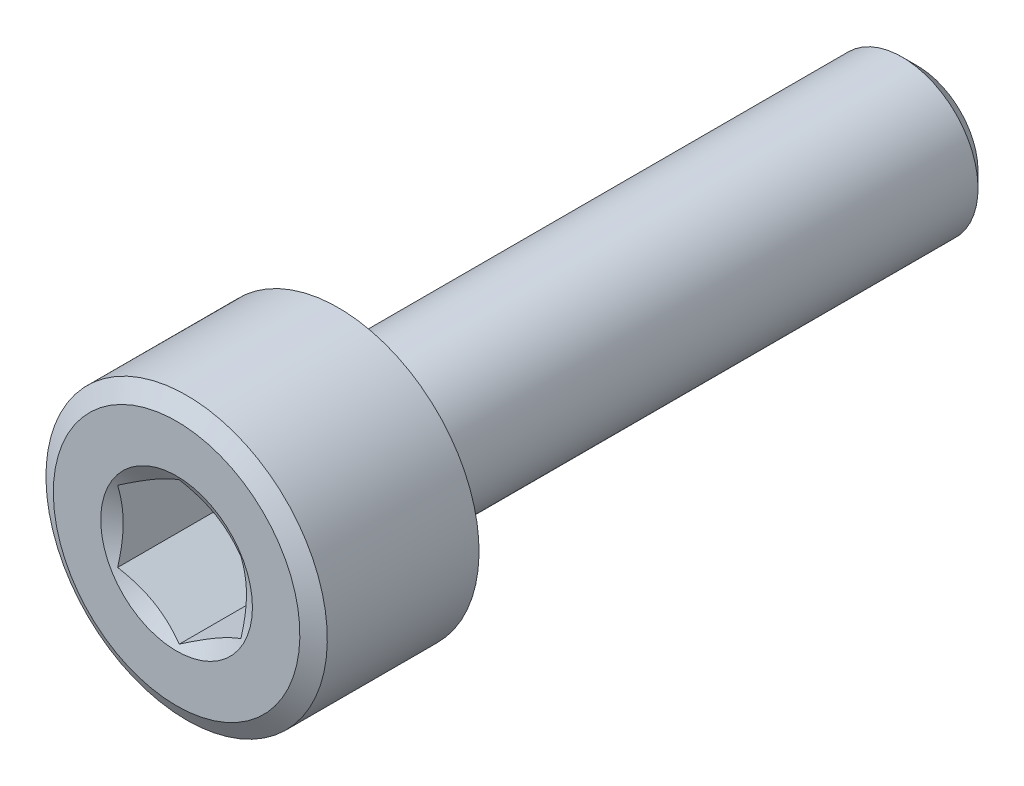
ISO-10303-21;
HEADER;
FILE_DESCRIPTION(('STEP AP214'),'2;1');
FILE_NAME('part.step','',(''),(''),'','','');
FILE_SCHEMA(('AUTOMOTIVE_DESIGN { 1 0 10303 214 1 1 1 1 }'));
ENDSEC;
DATA;
#1=APPLICATION_CONTEXT('core data for automotive mechanical design processes');
#2=APPLICATION_PROTOCOL_DEFINITION('international standard','automotive_design',2000,#1);
#3=PRODUCT_CONTEXT('',#1,'mechanical');
#4=PRODUCT('Part','Part','',(#3));
#5=PRODUCT_RELATED_PRODUCT_CATEGORY('part','',(#4));
#6=PRODUCT_DEFINITION_FORMATION('','',#4);
#7=PRODUCT_DEFINITION_CONTEXT('part definition',#1,'design');
#8=PRODUCT_DEFINITION('design','',#6,#7);
#9=PRODUCT_DEFINITION_SHAPE('','',#8);
#10=(LENGTH_UNIT() NAMED_UNIT(*) SI_UNIT(.MILLI.,.METRE.));
#11=(NAMED_UNIT(*) PLANE_ANGLE_UNIT() SI_UNIT($,.RADIAN.));
#12=(NAMED_UNIT(*) SI_UNIT($,.STERADIAN.) SOLID_ANGLE_UNIT());
#13=UNCERTAINTY_MEASURE_WITH_UNIT(LENGTH_MEASURE(1.E-05),#10,'distance_accuracy_value','');
#14=(GEOMETRIC_REPRESENTATION_CONTEXT(3) GLOBAL_UNCERTAINTY_ASSIGNED_CONTEXT((#13)) GLOBAL_UNIT_ASSIGNED_CONTEXT((#10,
#11,#12)) REPRESENTATION_CONTEXT('',''));
#15=CARTESIAN_POINT('',(0.,0.,0.));
#16=DIRECTION('',(0.,0.,1.));
#17=DIRECTION('',(1.,0.,0.));
#18=AXIS2_PLACEMENT_3D('',#15,#16,#17);
#19=CARTESIAN_POINT('',(0.,0.,0.));
#20=DIRECTION('',(0.,0.,-1.));
#21=DIRECTION('',(0.,1.,0.));
#22=AXIS2_PLACEMENT_3D('',#19,#20,#21);
#23=PLANE('',#22);
#24=CARTESIAN_POINT('',(0.,0.,0.));
#25=DIRECTION('',(0.,0.,1.));
#26=DIRECTION('',(1.,0.,0.));
#27=AXIS2_PLACEMENT_3D('',#24,#25,#26);
#28=CIRCLE('',#27,4.);
#29=CARTESIAN_POINT('',(4.,0.,0.));
#30=VERTEX_POINT('',#29);
#31=EDGE_CURVE('E219',#30,#30,#28,.T.);
#32=ORIENTED_EDGE('',*,*,#31,.F.);
#33=EDGE_LOOP('',(#32));
#34=FACE_BOUND('',#33,.T.);
#35=CARTESIAN_POINT('',(0.,0.,0.));
#36=DIRECTION('',(0.,0.,1.));
#37=DIRECTION('',(0.,-1.,0.));
#38=AXIS2_PLACEMENT_3D('',#35,#36,#37);
#39=CIRCLE('',#38,6.5);
#40=CARTESIAN_POINT('',(0.,-6.5,0.));
#41=VERTEX_POINT('',#40);
#42=EDGE_CURVE('E248',#41,#41,#39,.T.);
#43=ORIENTED_EDGE('',*,*,#42,.T.);
#44=EDGE_LOOP('',(#43));
#45=FACE_BOUND('',#44,.T.);
#46=ADVANCED_FACE('F36',(#34,#45),#23,.F.);
#47=CARTESIAN_POINT('',(0.,0.,-0.53));
#48=DIRECTION('',(0.,0.,-1.));
#49=DIRECTION('',(0.,1.,0.));
#50=AXIS2_PLACEMENT_3D('',#47,#48,#49);
#51=CONICAL_SURFACE('',#50,7.4179869280115,1.0471975511966);
#52=ORIENTED_EDGE('',*,*,#42,.F.);
#53=EDGE_LOOP('',(#52));
#54=FACE_BOUND('',#53,.T.);
#55=CARTESIAN_POINT('',(0.,0.,-0.53));
#56=DIRECTION('',(0.,0.,1.));
#57=DIRECTION('',(0.,-1.,0.));
#58=AXIS2_PLACEMENT_3D('',#55,#56,#57);
#59=CIRCLE('',#58,7.4179869280115);
#60=CARTESIAN_POINT('',(0.,-7.4179869280115,-0.53));
#61=VERTEX_POINT('',#60);
#62=EDGE_CURVE('E245',#61,#61,#59,.T.);
#63=ORIENTED_EDGE('',*,*,#62,.T.);
#64=EDGE_LOOP('',(#63));
#65=FACE_BOUND('',#64,.T.);
#66=ADVANCED_FACE('F112',(#54,#65),#51,.T.);
#67=CARTESIAN_POINT('',(0.,0.,0.));
#68=DIRECTION('',(0.,0.,1.));
#69=DIRECTION('',(0.,-1.,0.));
#70=AXIS2_PLACEMENT_3D('',#67,#68,#69);
#71=CYLINDRICAL_SURFACE('',#70,7.4179869280115);
#72=ORIENTED_EDGE('',*,*,#62,.F.);
#73=EDGE_LOOP('',(#72));
#74=FACE_BOUND('',#73,.T.);
#75=CARTESIAN_POINT('',(0.,0.,-8.53));
#76=DIRECTION('',(0.,0.,1.));
#77=DIRECTION('',(0.,-1.,0.));
#78=AXIS2_PLACEMENT_3D('',#75,#76,#77);
#79=CIRCLE('',#78,7.4179869280115);
#80=CARTESIAN_POINT('',(0.,-7.4179869280115,-8.53));
#81=VERTEX_POINT('',#80);
#82=EDGE_CURVE('E242',#81,#81,#79,.T.);
#83=ORIENTED_EDGE('',*,*,#82,.T.);
#84=EDGE_LOOP('',(#83));
#85=FACE_BOUND('',#84,.T.);
#86=ADVANCED_FACE('F117',(#74,#85),#71,.T.);
#87=CARTESIAN_POINT('',(0.,0.,-9.06));
#88=DIRECTION('',(0.,0.,1.));
#89=DIRECTION('',(0.,-1.,0.));
#90=AXIS2_PLACEMENT_3D('',#87,#88,#89);
#91=CONICAL_SURFACE('',#90,6.49999999999999,1.0471975511966);
#92=ORIENTED_EDGE('',*,*,#82,.F.);
#93=EDGE_LOOP('',(#92));
#94=FACE_BOUND('',#93,.T.);
#95=CARTESIAN_POINT('',(0.,0.,-9.06));
#96=DIRECTION('',(0.,0.,1.));
#97=DIRECTION('',(0.,-1.,0.));
#98=AXIS2_PLACEMENT_3D('',#95,#96,#97);
#99=CIRCLE('',#98,6.49999999999999);
#100=CARTESIAN_POINT('',(0.,-6.49999999999999,-9.06));
#101=VERTEX_POINT('',#100);
#102=EDGE_CURVE('E238',#101,#101,#99,.T.);
#103=ORIENTED_EDGE('',*,*,#102,.T.);
#104=EDGE_LOOP('',(#103));
#105=FACE_BOUND('',#104,.T.);
#106=ADVANCED_FACE('F125',(#94,#105),#91,.T.);
#107=CARTESIAN_POINT('',(0.,6.49999999999999,-9.06));
#108=DIRECTION('',(0.,0.,1.));
#109=DIRECTION('',(0.,-1.,0.));
#110=AXIS2_PLACEMENT_3D('',#107,#108,#109);
#111=PLANE('',#110);
#112=ORIENTED_EDGE('',*,*,#102,.F.);
#113=EDGE_LOOP('',(#112));
#114=FACE_BOUND('',#113,.T.);
#115=CARTESIAN_POINT('',(0.,0.,-9.06));
#116=DIRECTION('',(0.,0.,1.));
#117=DIRECTION('',(0.,-1.,0.));
#118=AXIS2_PLACEMENT_3D('',#115,#116,#117);
#119=CIRCLE('',#118,4.);
#120=CARTESIAN_POINT('',(0.,-4.,-9.06));
#121=VERTEX_POINT('',#120);
#122=EDGE_CURVE('E235',#121,#121,#119,.T.);
#123=ORIENTED_EDGE('',*,*,#122,.T.);
#124=EDGE_LOOP('',(#123));
#125=FACE_BOUND('',#124,.T.);
#126=ADVANCED_FACE('F129',(#114,#125),#111,.F.);
#127=CARTESIAN_POINT('',(0.,0.,0.));
#128=DIRECTION('',(0.,0.,1.));
#129=DIRECTION('',(0.,-1.,0.));
#130=AXIS2_PLACEMENT_3D('',#127,#128,#129);
#131=CYLINDRICAL_SURFACE('',#130,4.);
#132=CARTESIAN_POINT('',(0.,0.,-38.26));
#133=DIRECTION('',(0.,0.,1.));
#134=DIRECTION('',(0.,-1.,0.));
#135=AXIS2_PLACEMENT_3D('',#132,#133,#134);
#136=CIRCLE('',#135,4.);
#137=CARTESIAN_POINT('',(0.,-4.,-38.26));
#138=VERTEX_POINT('',#137);
#139=EDGE_CURVE('E251',#138,#138,#136,.T.);
#140=ORIENTED_EDGE('',*,*,#139,.T.);
#141=EDGE_LOOP('',(#140));
#142=FACE_BOUND('',#141,.T.);
#143=ORIENTED_EDGE('',*,*,#122,.F.);
#144=EDGE_LOOP('',(#143));
#145=FACE_BOUND('',#144,.T.);
#146=ADVANCED_FACE('F133',(#142,#145),#131,.T.);
#147=CARTESIAN_POINT('',(0.,4.,-39.06));
#148=DIRECTION('',(0.,0.,1.));
#149=DIRECTION('',(0.,-1.,0.));
#150=AXIS2_PLACEMENT_3D('',#147,#148,#149);
#151=PLANE('',#150);
#152=CARTESIAN_POINT('',(0.,0.,-39.06));
#153=DIRECTION('',(0.,0.,1.));
#154=DIRECTION('',(0.,-1.,0.));
#155=AXIS2_PLACEMENT_3D('',#152,#153,#154);
#156=CIRCLE('',#155,3.19999999999999);
#157=CARTESIAN_POINT('',(0.,-3.19999999999999,-39.06));
#158=VERTEX_POINT('',#157);
#159=EDGE_CURVE('E51',#158,#158,#156,.F.);
#160=ORIENTED_EDGE('',*,*,#159,.T.);
#161=EDGE_LOOP('',(#160));
#162=FACE_BOUND('',#161,.T.);
#163=ADVANCED_FACE('F137',(#162),#151,.F.);
#164=CARTESIAN_POINT('',(0.,0.,-38.26));
#165=DIRECTION('',(0.,0.,1.));
#166=DIRECTION('',(0.,-1.,0.));
#167=AXIS2_PLACEMENT_3D('',#164,#165,#166);
#168=CONICAL_SURFACE('',#167,4.,0.78539816339745);
#169=ORIENTED_EDGE('',*,*,#159,.F.);
#170=EDGE_LOOP('',(#169));
#171=FACE_BOUND('',#170,.T.);
#172=ORIENTED_EDGE('',*,*,#139,.F.);
#173=EDGE_LOOP('',(#172));
#174=FACE_BOUND('',#173,.T.);
#175=ADVANCED_FACE('F39',(#171,#174),#168,.T.);
#176=CARTESIAN_POINT('',(0.,0.,-2.30940107675847));
#177=DIRECTION('',(0.,0.,1.));
#178=DIRECTION('',(1.,0.,0.));
#179=AXIS2_PLACEMENT_3D('',#176,#177,#178);
#180=CONICAL_SURFACE('',#179,0.,1.0471975511966);
#181=ORIENTED_EDGE('',*,*,#31,.T.);
#182=EDGE_LOOP('',(#181));
#183=FACE_BOUND('',#182,.T.);
#184=CARTESIAN_POINT('',(3.2502,-1.87627290481245,-0.142667740348339));
#185=CARTESIAN_POINT('',(3.10737880748063,-1.95873075875949,-0.190292955189628));
#186=CARTESIAN_POINT('',(2.96332479190713,-2.0419003834287,-0.233606431856647));
#187=CARTESIAN_POINT('',(2.67272228671431,-2.20967981802895,-0.309210723922063));
#188=CARTESIAN_POINT('',(2.52616863329362,-2.29429260928211,-0.341474792986621));
#189=CARTESIAN_POINT('',(2.2348775937677,-2.46246956936493,-0.391698768714531));
#190=CARTESIAN_POINT('',(2.09018502771157,-2.54600786132717,-0.409992938219789));
#191=CARTESIAN_POINT('',(1.80011902775738,-2.71347754448348,-0.431832814317877));
#192=CARTESIAN_POINT('',(1.6547466482515,-2.79740832692394,-0.435396605746873));
#193=CARTESIAN_POINT('',(1.38310759119938,-2.95423920963539,-0.427984785522014));
#194=CARTESIAN_POINT('',(1.25680026129147,-3.02716278055835,-0.41882902776747));
#195=CARTESIAN_POINT('',(1.00500849737306,-3.17253482323637,-0.389809996939981));
#196=CARTESIAN_POINT('',(0.879524934336008,-3.24498279213469,-0.369936809818711));
#197=CARTESIAN_POINT('',(0.62721397527239,-3.39065459226956,-0.320255122527025));
#198=CARTESIAN_POINT('',(0.500418515106996,-3.46385998532807,-0.290236012042402));
#199=CARTESIAN_POINT('',(0.248718778280333,-3.6091788961399,-0.2221043374302));
#200=CARTESIAN_POINT('',(0.123811276681379,-3.68129427581187,-0.184007783111052));
#201=CARTESIAN_POINT('',(-0.000200000000002013,-3.75289221978641,-0.142667740348337));
#202=B_SPLINE_CURVE_WITH_KNOTS('',3,(#184,#185,#186,#187,#188,#189,#190,#191,#192,#193,#194,
#195,#196,#197,#198,#199,#200,#201),.UNSPECIFIED.,.F.,.F.,(4,2,2,2,2,2,2,2,4),(0.,
0.51516683149057,1.03157201112063,1.53519622021027,2.03820193386596,2.47618783582282,
2.91457958885821,3.3626959233107,3.80993224062138),.UNSPECIFIED.);
#203=CARTESIAN_POINT('',(3.25,-1.87638837486631,-0.142734410091848));
#204=VERTEX_POINT('',#203);
#205=CARTESIAN_POINT('',(0.,-3.75277674973257,-0.142734410091833));
#206=VERTEX_POINT('',#205);
#207=EDGE_CURVE('E151',#204,#206,#202,.T.);
#208=ORIENTED_EDGE('',*,*,#207,.T.);
#209=CARTESIAN_POINT('',(0.000199999999998188,-3.75289221978641,-0.142667740348337));
#210=CARTESIAN_POINT('',(-0.142621192519368,-3.67043436583937,-0.190292955189626));
#211=CARTESIAN_POINT('',(-0.286675208092872,-3.58726474117016,-0.233606431856646));
#212=CARTESIAN_POINT('',(-0.577277713285697,-3.4194853065699,-0.309210723922062));
#213=CARTESIAN_POINT('',(-0.723831366706382,-3.33487251531675,-0.34147479298662));
#214=CARTESIAN_POINT('',(-1.0151224062323,-3.16669555523393,-0.39169876871453));
#215=CARTESIAN_POINT('',(-1.15981497228843,-3.08315726327169,-0.409992938219789));
#216=CARTESIAN_POINT('',(-1.44988097224262,-2.91568758011538,-0.431832814317876));
#217=CARTESIAN_POINT('',(-1.5952533517485,-2.83175679767492,-0.435396605746872));
#218=CARTESIAN_POINT('',(-1.86689240880062,-2.67492591496346,-0.427984785522013));
#219=CARTESIAN_POINT('',(-1.99319973870853,-2.60200234404051,-0.418829027767469));
#220=CARTESIAN_POINT('',(-2.24499150262694,-2.45663030136249,-0.389809996939981));
#221=CARTESIAN_POINT('',(-2.37047506566399,-2.38418233246417,-0.369936809818711));
#222=CARTESIAN_POINT('',(-2.62278602472761,-2.2385105323293,-0.320255122527024));
#223=CARTESIAN_POINT('',(-2.74958148489301,-2.16530513927078,-0.290236012042401));
#224=CARTESIAN_POINT('',(-3.00128122171967,-2.01998622845895,-0.2221043374302));
#225=CARTESIAN_POINT('',(-3.12618872331862,-1.94787084878699,-0.184007783111052));
#226=CARTESIAN_POINT('',(-3.2502,-1.87627290481245,-0.142667740348338));
#227=B_SPLINE_CURVE_WITH_KNOTS('',3,(#209,#210,#211,#212,#213,#214,#215,#216,#217,#218,#219,
#220,#221,#222,#223,#224,#225,#226),.UNSPECIFIED.,.F.,.F.,(4,2,2,2,2,2,2,2,4),(0.,
0.51516683149057,1.03157201112063,1.53519622021027,2.03820193386596,2.47618783582282,
2.91457958885821,3.36269592331071,3.80993224062138),.UNSPECIFIED.);
#228=CARTESIAN_POINT('',(-3.25,-1.87638837486629,-0.142734410091833));
#229=VERTEX_POINT('',#228);
#230=EDGE_CURVE('E159',#206,#229,#227,.T.);
#231=ORIENTED_EDGE('',*,*,#230,.T.);
#232=CARTESIAN_POINT('',(-3.25,-6.28302306366704,1.77466874057532));
#233=CARTESIAN_POINT('',(-3.25,-6.13618590982133,1.69937983319147));
#234=CARTESIAN_POINT('',(-3.25,-5.98912900246734,1.624515687302));
#235=CARTESIAN_POINT('',(-3.25,-5.6944759741307,1.47584932594023));
#236=CARTESIAN_POINT('',(-3.25,-5.54687984231,1.40204713196133));
#237=CARTESIAN_POINT('',(-3.25,-5.25080597530328,1.25559716966086));
#238=CARTESIAN_POINT('',(-3.25,-5.10232717529243,1.18295155018856));
#239=CARTESIAN_POINT('',(-3.25,-4.80460616133141,1.03923375269448));
#240=CARTESIAN_POINT('',(-3.25,-4.65536393637161,0.968161597443385));
#241=CARTESIAN_POINT('',(-3.25,-4.3482388240758,0.824350246031028));
#242=CARTESIAN_POINT('',(-3.25,-4.19030745994306,0.751714277013019));
#243=CARTESIAN_POINT('',(-3.25,-3.87321439087415,0.60918213039114));
#244=CARTESIAN_POINT('',(-3.25,-3.71405272059363,0.539285875948367));
#245=CARTESIAN_POINT('',(-3.25,-3.39433152435617,0.403060730219636));
#246=CARTESIAN_POINT('',(-3.25,-3.23377304115076,0.336729405465197));
#247=CARTESIAN_POINT('',(-3.25,-2.91079241277799,0.208629702903767));
#248=CARTESIAN_POINT('',(-3.25,-2.74836983060161,0.146862421397306));
#249=CARTESIAN_POINT('',(-3.25,-2.3932593347769,0.0192372651000433));
#250=CARTESIAN_POINT('',(-3.25,-2.20016296217721,-0.0455021871795711));
#251=CARTESIAN_POINT('',(-3.25,-1.81057388586937,-0.163613278802622));
#252=CARTESIAN_POINT('',(-3.25,-1.61408300411984,-0.216990823379039));
#253=CARTESIAN_POINT('',(-3.25,-1.22115941812114,-0.307564067974847));
#254=CARTESIAN_POINT('',(-3.25,-1.02479529609204,-0.345045561834818));
#255=CARTESIAN_POINT('',(-3.25,-0.728308590533658,-0.387273009061771));
#256=CARTESIAN_POINT('',(-3.25,-0.629165396987618,-0.399015926261496));
#257=CARTESIAN_POINT('',(-3.25,-0.430417528013067,-0.417474826251221));
#258=CARTESIAN_POINT('',(-3.25,-0.330812923234017,-0.424191554597166));
#259=CARTESIAN_POINT('',(-3.25,-0.130142809504359,-0.432409175990876));
#260=CARTESIAN_POINT('',(-3.25,-0.0290745711190829,-0.433843986089623));
#261=CARTESIAN_POINT('',(-3.25,0.17299153553624,-0.431261674073826));
#262=CARTESIAN_POINT('',(-3.25,0.273989403653629,-0.427244540168722));
#263=CARTESIAN_POINT('',(-3.25,0.475655744644864,-0.413905439412912));
#264=CARTESIAN_POINT('',(-3.25,0.576324132128424,-0.404582192367688));
#265=CARTESIAN_POINT('',(-3.25,0.777080992854029,-0.380957406941178));
#266=CARTESIAN_POINT('',(-3.25,0.877169370900214,-0.366655073633673));
#267=CARTESIAN_POINT('',(-3.25,1.180202524539,-0.316287209854313));
#268=CARTESIAN_POINT('',(-3.25,1.38196935278258,-0.273049253353294));
#269=CARTESIAN_POINT('',(-3.25,1.781745345714,-0.172061863313915));
#270=CARTESIAN_POINT('',(-3.25,1.97975352343435,-0.114308673461032));
#271=CARTESIAN_POINT('',(-3.25,2.359508536252,0.00767812652581849));
#272=CARTESIAN_POINT('',(-3.25,2.54147358980825,0.0712432913332263));
#273=CARTESIAN_POINT('',(-3.25,2.90287990047173,0.205223867512466));
#274=CARTESIAN_POINT('',(-3.25,3.08232060819841,0.275640744430092));
#275=CARTESIAN_POINT('',(-3.25,3.43929334915309,0.421616062930752));
#276=CARTESIAN_POINT('',(-3.25,3.61682327952844,0.497179608143012));
#277=CARTESIAN_POINT('',(-3.25,3.9701873435537,0.652112383221149));
#278=CARTESIAN_POINT('',(-3.25,4.14602162469331,0.731481278440473));
#279=CARTESIAN_POINT('',(-3.25,4.48679045175632,0.888717819070501));
#280=CARTESIAN_POINT('',(-3.25,4.65179643159254,0.966431251913797));
#281=CARTESIAN_POINT('',(-3.25,4.9808333848642,1.12390357783724));
#282=CARTESIAN_POINT('',(-3.25,5.14486432916273,1.20366253166881));
#283=CARTESIAN_POINT('',(-3.25,5.471630172705,1.36455963080413));
#284=CARTESIAN_POINT('',(-3.25,5.63436749167949,1.44569287310471));
#285=CARTESIAN_POINT('',(-3.25,5.95916583092807,1.60927012664637));
#286=CARTESIAN_POINT('',(-3.25,6.12122690542083,1.69171403015149));
#287=CARTESIAN_POINT('',(-3.25,6.28302306366704,1.77466874057532));
#288=B_SPLINE_CURVE_WITH_KNOTS('',3,(#232,#233,#234,#235,#236,#237,#238,#239,#240,#241,#242,
#243,#244,#245,#246,#247,#248,#249,#250,#251,#252,#253,#254,#255,#256,#257,#258,#259,#260,#261,
#262,#263,#264,#265,#266,#267,#268,#269,#270,#271,#272,#273,#274,#275,#276,#277,#278,#279,#280,
#281,#282,#283,#284,#285,#286,#287),.UNSPECIFIED.,.F.,.F.,(4,2,2,2,2,2,2,2,2,2,2,2,2,2,2,2,2,2,
2,2,2,2,2,2,2,2,2,4),(0.,0.495043446910767,0.990096899212797,1.48598243484971,1.98187514210345,
2.50335701341636,3.0248242486032,3.54593088028625,4.06716227957574,4.67788371948299,
5.28828696404167,5.88719563820004,6.18659537924677,6.48595070024978,6.78903881670332,
7.09212758862666,7.39528951714553,7.69849986859894,8.31674069440946,8.93514167627232,
9.51320478528894,10.0913918119612,10.6701607815239,11.2488789465478,11.7960338959909,
12.3432051146514,12.8887208157102,13.4341919050444),.UNSPECIFIED.);
#289=CARTESIAN_POINT('',(-3.25,1.87638837486629,-0.142734410091831));
#290=VERTEX_POINT('',#289);
#291=EDGE_CURVE('E188',#229,#290,#288,.T.);
#292=ORIENTED_EDGE('',*,*,#291,.T.);
#293=CARTESIAN_POINT('',(-3.2502,1.87627290481245,-0.142667740348336));
#294=CARTESIAN_POINT('',(-3.10737880748064,1.95873075875949,-0.190292955189625));
#295=CARTESIAN_POINT('',(-2.96332479190713,2.0419003834287,-0.233606431856645));
#296=CARTESIAN_POINT('',(-2.67272228671431,2.20967981802896,-0.309210723922061));
#297=CARTESIAN_POINT('',(-2.52616863329362,2.29429260928211,-0.341474792986619));
#298=CARTESIAN_POINT('',(-2.2348775937677,2.46246956936493,-0.391698768714528));
#299=CARTESIAN_POINT('',(-2.09018502771158,2.54600786132717,-0.409992938219786));
#300=CARTESIAN_POINT('',(-1.80011902775739,2.71347754448348,-0.431832814317874));
#301=CARTESIAN_POINT('',(-1.6547466482515,2.79740832692394,-0.435396605746871));
#302=CARTESIAN_POINT('',(-1.38310759119938,2.9542392096354,-0.427984785522011));
#303=CARTESIAN_POINT('',(-1.25680026129147,3.02716278055835,-0.418829027767467));
#304=CARTESIAN_POINT('',(-1.00500849737306,3.17253482323638,-0.389809996939978));
#305=CARTESIAN_POINT('',(-0.879524934336009,3.24498279213469,-0.369936809818709));
#306=CARTESIAN_POINT('',(-0.627213975272391,3.39065459226957,-0.320255122527023));
#307=CARTESIAN_POINT('',(-0.500418515106997,3.46385998532808,-0.290236012042399));
#308=CARTESIAN_POINT('',(-0.248718778280336,3.60917889613991,-0.222104337430197));
#309=CARTESIAN_POINT('',(-0.123811276681381,3.68129427581187,-0.184007783111049));
#310=CARTESIAN_POINT('',(0.000199999999999539,3.75289221978641,-0.142667740348335));
#311=B_SPLINE_CURVE_WITH_KNOTS('',3,(#293,#294,#295,#296,#297,#298,#299,#300,#301,#302,#303,
#304,#305,#306,#307,#308,#309,#310),.UNSPECIFIED.,.F.,.F.,(4,2,2,2,2,2,2,2,4),(0.,
0.515166831490571,1.03157201112064,1.53519622021027,2.03820193386597,2.47618783582282,
2.91457958885821,3.36269592331071,3.80993224062138),.UNSPECIFIED.);
#312=CARTESIAN_POINT('',(0.,3.75277674973258,-0.14273441009183));
#313=VERTEX_POINT('',#312);
#314=EDGE_CURVE('E182',#290,#313,#311,.T.);
#315=ORIENTED_EDGE('',*,*,#314,.T.);
#316=CARTESIAN_POINT('',(-0.000200000000000779,3.75289221978641,-0.142667740348335));
#317=CARTESIAN_POINT('',(0.142621192519366,3.67043436583937,-0.190292955189625));
#318=CARTESIAN_POINT('',(0.28667520809287,3.58726474117016,-0.233606431856645));
#319=CARTESIAN_POINT('',(0.577277713285695,3.41948530656991,-0.309210723922061));
#320=CARTESIAN_POINT('',(0.72383136670638,3.33487251531675,-0.341474792986618));
#321=CARTESIAN_POINT('',(1.0151224062323,3.16669555523393,-0.391698768714528));
#322=CARTESIAN_POINT('',(1.15981497228843,3.08315726327169,-0.409992938219786));
#323=CARTESIAN_POINT('',(1.44988097224262,2.91568758011538,-0.431832814317874));
#324=CARTESIAN_POINT('',(1.5952533517485,2.83175679767492,-0.435396605746871));
#325=CARTESIAN_POINT('',(1.86689240880062,2.67492591496347,-0.427984785522012));
#326=CARTESIAN_POINT('',(1.99319973870853,2.60200234404051,-0.418829027767467));
#327=CARTESIAN_POINT('',(2.24499150262694,2.45663030136249,-0.38980999693998));
#328=CARTESIAN_POINT('',(2.37047506566399,2.38418233246417,-0.36993680981871));
#329=CARTESIAN_POINT('',(2.62278602472761,2.2385105323293,-0.320255122527024));
#330=CARTESIAN_POINT('',(2.749581484893,2.16530513927079,-0.290236012042401));
#331=CARTESIAN_POINT('',(3.00128122171966,2.01998622845896,-0.2221043374302));
#332=CARTESIAN_POINT('',(3.12618872331862,1.947870848787,-0.184007783111052));
#333=CARTESIAN_POINT('',(3.2502,1.87627290481245,-0.142667740348338));
#334=B_SPLINE_CURVE_WITH_KNOTS('',3,(#316,#317,#318,#319,#320,#321,#322,#323,#324,#325,#326,
#327,#328,#329,#330,#331,#332,#333),.UNSPECIFIED.,.F.,.F.,(4,2,2,2,2,2,2,2,4),(0.,
0.515166831490571,1.03157201112064,1.53519622021027,2.03820193386597,2.47618783582282,
2.91457958885821,3.3626959233107,3.80993224062138),.UNSPECIFIED.);
#335=CARTESIAN_POINT('',(3.25,1.87638837486629,-0.142734410091833));
#336=VERTEX_POINT('',#335);
#337=EDGE_CURVE('E57',#313,#336,#334,.T.);
#338=ORIENTED_EDGE('',*,*,#337,.T.);
#339=CARTESIAN_POINT('',(3.25,6.28302306366705,1.77466874057532));
#340=CARTESIAN_POINT('',(3.25,6.13618590982134,1.69937983319148));
#341=CARTESIAN_POINT('',(3.25,5.98912900246735,1.62451568730201));
#342=CARTESIAN_POINT('',(3.25,5.69447597413071,1.47584932594024));
#343=CARTESIAN_POINT('',(3.25,5.54687984231001,1.40204713196134));
#344=CARTESIAN_POINT('',(3.25,5.25080597530329,1.25559716966086));
#345=CARTESIAN_POINT('',(3.25,5.10232717529244,1.18295155018857));
#346=CARTESIAN_POINT('',(3.25,4.80460616133142,1.03923375269449));
#347=CARTESIAN_POINT('',(3.25,4.65536393637162,0.968161597443388));
#348=CARTESIAN_POINT('',(3.25,4.34823882407581,0.824350246031032));
#349=CARTESIAN_POINT('',(3.25,4.19030745994307,0.751714277013022));
#350=CARTESIAN_POINT('',(3.25,3.87321439087416,0.609182130391142));
#351=CARTESIAN_POINT('',(3.25,3.71405272059364,0.539285875948369));
#352=CARTESIAN_POINT('',(3.25,3.39433152435617,0.403060730219637));
#353=CARTESIAN_POINT('',(3.25,3.23377304115076,0.336729405465198));
#354=CARTESIAN_POINT('',(3.25,2.910792412778,0.208629702903768));
#355=CARTESIAN_POINT('',(3.25,2.74836983060162,0.146862421397307));
#356=CARTESIAN_POINT('',(3.25,2.3932593347769,0.0192372651000441));
#357=CARTESIAN_POINT('',(3.25,2.20016296217722,-0.0455021871795703));
#358=CARTESIAN_POINT('',(3.25,1.81057388586938,-0.163613278802622));
#359=CARTESIAN_POINT('',(3.25,1.61408300411984,-0.216990823379039));
#360=CARTESIAN_POINT('',(3.25,1.22115941812115,-0.307564067974847));
#361=CARTESIAN_POINT('',(3.25,1.02479529609205,-0.345045561834819));
#362=CARTESIAN_POINT('',(3.25,0.728308590533665,-0.387273009061772));
#363=CARTESIAN_POINT('',(3.25,0.629165396987625,-0.399015926261497));
#364=CARTESIAN_POINT('',(3.25,0.430417528013074,-0.417474826251223));
#365=CARTESIAN_POINT('',(3.25,0.330812923234024,-0.424191554597168));
#366=CARTESIAN_POINT('',(3.25,0.130142809504367,-0.432409175990877));
#367=CARTESIAN_POINT('',(3.25,0.0290745711190903,-0.433843986089625));
#368=CARTESIAN_POINT('',(3.25,-0.172991535536233,-0.431261674073829));
#369=CARTESIAN_POINT('',(3.25,-0.273989403653621,-0.427244540168724));
#370=CARTESIAN_POINT('',(3.25,-0.475655744644856,-0.413905439412915));
#371=CARTESIAN_POINT('',(3.25,-0.576324132128417,-0.404582192367691));
#372=CARTESIAN_POINT('',(3.25,-0.777080992854022,-0.380957406941181));
#373=CARTESIAN_POINT('',(3.25,-0.877169370900206,-0.366655073633676));
#374=CARTESIAN_POINT('',(3.25,-1.18020252453899,-0.316287209854317));
#375=CARTESIAN_POINT('',(3.25,-1.38196935278258,-0.273049253353298));
#376=CARTESIAN_POINT('',(3.25,-1.78174534571399,-0.172061863313919));
#377=CARTESIAN_POINT('',(3.25,-1.97975352343435,-0.114308673461036));
#378=CARTESIAN_POINT('',(3.25,-2.359508536252,0.00767812652581504));
#379=CARTESIAN_POINT('',(3.25,-2.54147358980824,0.0712432913332229));
#380=CARTESIAN_POINT('',(3.25,-2.90287990047172,0.205223867512462));
#381=CARTESIAN_POINT('',(3.25,-3.0823206081984,0.275640744430089));
#382=CARTESIAN_POINT('',(3.25,-3.43929334915309,0.421616062930749));
#383=CARTESIAN_POINT('',(3.25,-3.61682327952843,0.497179608143009));
#384=CARTESIAN_POINT('',(3.25,-3.9701873435537,0.652112383221145));
#385=CARTESIAN_POINT('',(3.25,-4.1460216246933,0.73148127844047));
#386=CARTESIAN_POINT('',(3.25,-4.48679045175632,0.888717819070499));
#387=CARTESIAN_POINT('',(3.25,-4.65179643159253,0.966431251913794));
#388=CARTESIAN_POINT('',(3.25,-4.9808333848642,1.12390357783724));
#389=CARTESIAN_POINT('',(3.25,-5.14486432916273,1.20366253166881));
#390=CARTESIAN_POINT('',(3.25,-5.471630172705,1.36455963080413));
#391=CARTESIAN_POINT('',(3.25,-5.63436749167949,1.44569287310471));
#392=CARTESIAN_POINT('',(3.25,-5.95916583092807,1.60927012664637));
#393=CARTESIAN_POINT('',(3.25,-6.12122690542084,1.69171403015149));
#394=CARTESIAN_POINT('',(3.25,-6.28302306366704,1.77466874057532));
#395=B_SPLINE_CURVE_WITH_KNOTS('',3,(#339,#340,#341,#342,#343,#344,#345,#346,#347,#348,#349,
#350,#351,#352,#353,#354,#355,#356,#357,#358,#359,#360,#361,#362,#363,#364,#365,#366,#367,#368,
#369,#370,#371,#372,#373,#374,#375,#376,#377,#378,#379,#380,#381,#382,#383,#384,#385,#386,#387,
#388,#389,#390,#391,#392,#393,#394),.UNSPECIFIED.,.F.,.F.,(4,2,2,2,2,2,2,2,2,2,2,2,2,2,2,2,2,2,
2,2,2,2,2,2,2,2,2,4),(0.,0.495043446910768,0.990096899212797,1.48598243484971,1.98187514210345,
2.50335701341637,3.0248242486032,3.54593088028626,4.06716227957574,4.67788371948299,
5.28828696404168,5.88719563820005,6.18659537924678,6.48595070024978,6.78903881670332,
7.09212758862667,7.39528951714553,7.69849986859894,8.31674069440946,8.93514167627232,
9.51320478528894,10.0913918119612,10.6701607815239,11.2488789465478,11.7960338959909,
12.3432051146514,12.8887208157102,13.4341919050444),.UNSPECIFIED.);
#396=EDGE_CURVE('E11',#336,#204,#395,.T.);
#397=ORIENTED_EDGE('',*,*,#396,.T.);
#398=EDGE_LOOP('',(#208,#231,#292,#315,#338,#397));
#399=FACE_BOUND('',#398,.T.);
#400=ADVANCED_FACE('F166',(#183,#399),#180,.F.);
#401=CARTESIAN_POINT('',(3.25,-1.87638837486629,-6.));
#402=DIRECTION('',(1.,0.,0.));
#403=DIRECTION('',(0.,1.,0.));
#404=AXIS2_PLACEMENT_3D('',#401,#402,#403);
#405=PLANE('',#404);
#406=ORIENTED_EDGE('',*,*,#396,.F.);
#407=DIRECTION('',(0.,0.,1.));
#408=VECTOR('',#407,1.);
#409=CARTESIAN_POINT('',(3.25,1.87638837486629,-6.));
#410=LINE('',#409,#408);
#411=CARTESIAN_POINT('',(3.25,1.87638837486629,-6.));
#412=VERTEX_POINT('',#411);
#413=EDGE_CURVE('E218',#412,#336,#410,.T.);
#414=ORIENTED_EDGE('',*,*,#413,.F.);
#415=DIRECTION('',(0.,1.,0.));
#416=VECTOR('',#415,1.);
#417=CARTESIAN_POINT('',(3.25,-1.87638837486629,-6.));
#418=LINE('',#417,#416);
#419=CARTESIAN_POINT('',(3.25,-1.8763883748663,-6.));
#420=VERTEX_POINT('',#419);
#421=EDGE_CURVE('E381',#420,#412,#418,.T.);
#422=ORIENTED_EDGE('',*,*,#421,.F.);
#423=DIRECTION('',(0.,0.,1.));
#424=VECTOR('',#423,1.);
#425=CARTESIAN_POINT('',(3.25,-1.87638837486629,-6.));
#426=LINE('',#425,#424);
#427=EDGE_CURVE('E228',#420,#204,#426,.T.);
#428=ORIENTED_EDGE('',*,*,#427,.T.);
#429=EDGE_LOOP('',(#406,#414,#422,#428));
#430=FACE_BOUND('',#429,.T.);
#431=ADVANCED_FACE('F147',(#430),#405,.F.);
#432=CARTESIAN_POINT('',(3.25,1.87638837486629,-6.));
#433=DIRECTION('',(0.5,0.866025403784439,0.));
#434=DIRECTION('',(-0.866025403784439,0.5,0.));
#435=AXIS2_PLACEMENT_3D('',#432,#433,#434);
#436=PLANE('',#435);
#437=ORIENTED_EDGE('',*,*,#337,.F.);
#438=DIRECTION('',(0.,0.,1.));
#439=VECTOR('',#438,1.);
#440=CARTESIAN_POINT('',(0.,3.75277674973258,-6.));
#441=LINE('',#440,#439);
#442=CARTESIAN_POINT('',(0.,3.75277674973258,-6.));
#443=VERTEX_POINT('',#442);
#444=EDGE_CURVE('E215',#443,#313,#441,.T.);
#445=ORIENTED_EDGE('',*,*,#444,.F.);
#446=DIRECTION('',(-0.866025403784439,0.5,0.));
#447=VECTOR('',#446,1.);
#448=CARTESIAN_POINT('',(3.25,1.87638837486629,-6.));
#449=LINE('',#448,#447);
#450=EDGE_CURVE('E382',#412,#443,#449,.T.);
#451=ORIENTED_EDGE('',*,*,#450,.F.);
#452=ORIENTED_EDGE('',*,*,#413,.T.);
#453=EDGE_LOOP('',(#437,#445,#451,#452));
#454=FACE_BOUND('',#453,.T.);
#455=ADVANCED_FACE('F202',(#454),#436,.F.);
#456=CARTESIAN_POINT('',(0.,3.75277674973258,-6.));
#457=DIRECTION('',(-0.5,0.866025403784439,0.));
#458=DIRECTION('',(-0.866025403784439,-0.5,0.));
#459=AXIS2_PLACEMENT_3D('',#456,#457,#458);
#460=PLANE('',#459);
#461=ORIENTED_EDGE('',*,*,#314,.F.);
#462=DIRECTION('',(0.,0.,1.));
#463=VECTOR('',#462,1.);
#464=CARTESIAN_POINT('',(-3.25,1.87638837486629,-6.));
#465=LINE('',#464,#463);
#466=CARTESIAN_POINT('',(-3.25,1.87638837486629,-6.));
#467=VERTEX_POINT('',#466);
#468=EDGE_CURVE('E224',#467,#290,#465,.T.);
#469=ORIENTED_EDGE('',*,*,#468,.F.);
#470=DIRECTION('',(-0.866025403784439,-0.5,0.));
#471=VECTOR('',#470,1.);
#472=CARTESIAN_POINT('',(0.,3.75277674973258,-6.));
#473=LINE('',#472,#471);
#474=EDGE_CURVE('E223',#443,#467,#473,.T.);
#475=ORIENTED_EDGE('',*,*,#474,.F.);
#476=ORIENTED_EDGE('',*,*,#444,.T.);
#477=EDGE_LOOP('',(#461,#469,#475,#476));
#478=FACE_BOUND('',#477,.T.);
#479=ADVANCED_FACE('F197',(#478),#460,.F.);
#480=CARTESIAN_POINT('',(-3.25,1.87638837486629,-6.));
#481=DIRECTION('',(-1.,0.,0.));
#482=DIRECTION('',(0.,-1.,0.));
#483=AXIS2_PLACEMENT_3D('',#480,#481,#482);
#484=PLANE('',#483);
#485=ORIENTED_EDGE('',*,*,#291,.F.);
#486=DIRECTION('',(0.,0.,1.));
#487=VECTOR('',#486,1.);
#488=CARTESIAN_POINT('',(-3.25,-1.87638837486629,-6.));
#489=LINE('',#488,#487);
#490=CARTESIAN_POINT('',(-3.25,-1.87638837486629,-6.));
#491=VERTEX_POINT('',#490);
#492=EDGE_CURVE('E226',#491,#229,#489,.T.);
#493=ORIENTED_EDGE('',*,*,#492,.F.);
#494=DIRECTION('',(0.,-1.,0.));
#495=VECTOR('',#494,1.);
#496=CARTESIAN_POINT('',(-3.25,1.87638837486629,-6.));
#497=LINE('',#496,#495);
#498=EDGE_CURVE('E363',#467,#491,#497,.T.);
#499=ORIENTED_EDGE('',*,*,#498,.F.);
#500=ORIENTED_EDGE('',*,*,#468,.T.);
#501=EDGE_LOOP('',(#485,#493,#499,#500));
#502=FACE_BOUND('',#501,.T.);
#503=ADVANCED_FACE('F194',(#502),#484,.F.);
#504=CARTESIAN_POINT('',(-3.25,-1.87638837486629,-6.));
#505=DIRECTION('',(-0.5,-0.866025403784438,0.));
#506=DIRECTION('',(0.866025403784439,-0.5,0.));
#507=AXIS2_PLACEMENT_3D('',#504,#505,#506);
#508=PLANE('',#507);
#509=ORIENTED_EDGE('',*,*,#230,.F.);
#510=DIRECTION('',(0.,0.,1.));
#511=VECTOR('',#510,1.);
#512=CARTESIAN_POINT('',(0.,-3.75277674973257,-6.));
#513=LINE('',#512,#511);
#514=CARTESIAN_POINT('',(0.,-3.75277674973258,-6.));
#515=VERTEX_POINT('',#514);
#516=EDGE_CURVE('E239',#515,#206,#513,.T.);
#517=ORIENTED_EDGE('',*,*,#516,.F.);
#518=DIRECTION('',(0.866025403784438,-0.5,0.));
#519=VECTOR('',#518,1.);
#520=CARTESIAN_POINT('',(-3.25,-1.87638837486629,-6.));
#521=LINE('',#520,#519);
#522=EDGE_CURVE('E234',#491,#515,#521,.T.);
#523=ORIENTED_EDGE('',*,*,#522,.F.);
#524=ORIENTED_EDGE('',*,*,#492,.T.);
#525=EDGE_LOOP('',(#509,#517,#523,#524));
#526=FACE_BOUND('',#525,.T.);
#527=ADVANCED_FACE('F145',(#526),#508,.F.);
#528=CARTESIAN_POINT('',(0.,-3.75277674973257,-6.));
#529=DIRECTION('',(0.5,-0.866025403784439,0.));
#530=DIRECTION('',(0.866025403784439,0.5,0.));
#531=AXIS2_PLACEMENT_3D('',#528,#529,#530);
#532=PLANE('',#531);
#533=ORIENTED_EDGE('',*,*,#207,.F.);
#534=ORIENTED_EDGE('',*,*,#427,.F.);
#535=DIRECTION('',(0.866025403784439,0.5,0.));
#536=VECTOR('',#535,1.);
#537=CARTESIAN_POINT('',(0.,-3.75277674973257,-6.));
#538=LINE('',#537,#536);
#539=EDGE_CURVE('E158',#515,#420,#538,.T.);
#540=ORIENTED_EDGE('',*,*,#539,.F.);
#541=ORIENTED_EDGE('',*,*,#516,.T.);
#542=EDGE_LOOP('',(#533,#534,#540,#541));
#543=FACE_BOUND('',#542,.T.);
#544=ADVANCED_FACE('F142',(#543),#532,.F.);
#545=CARTESIAN_POINT('',(0.,0.,-6.));
#546=DIRECTION('',(0.,0.,-1.));
#547=DIRECTION('',(-1.,0.,0.));
#548=AXIS2_PLACEMENT_3D('',#545,#546,#547);
#549=PLANE('',#548);
#550=ORIENTED_EDGE('',*,*,#539,.T.);
#551=CARTESIAN_POINT('',(0.,0.,-6.));
#552=DIRECTION('',(0.,0.,1.));
#553=DIRECTION('',(1.,0.,0.));
#554=AXIS2_PLACEMENT_3D('',#551,#552,#553);
#555=CIRCLE('',#554,3.75277674973258);
#556=EDGE_CURVE('E393',#515,#420,#555,.T.);
#557=ORIENTED_EDGE('',*,*,#556,.F.);
#558=EDGE_LOOP('',(#550,#557));
#559=FACE_BOUND('',#558,.T.);
#560=ADVANCED_FACE('F108',(#559),#549,.T.);
#561=ORIENTED_EDGE('',*,*,#421,.T.);
#562=EDGE_CURVE('E390',#420,#412,#555,.T.);
#563=ORIENTED_EDGE('',*,*,#562,.F.);
#564=EDGE_LOOP('',(#561,#563));
#565=FACE_BOUND('',#564,.T.);
#566=ADVANCED_FACE('F313',(#565),#549,.T.);
#567=ORIENTED_EDGE('',*,*,#450,.T.);
#568=EDGE_CURVE('E387',#412,#443,#555,.T.);
#569=ORIENTED_EDGE('',*,*,#568,.F.);
#570=EDGE_LOOP('',(#567,#569));
#571=FACE_BOUND('',#570,.T.);
#572=ADVANCED_FACE('F322',(#571),#549,.T.);
#573=ORIENTED_EDGE('',*,*,#474,.T.);
#574=EDGE_CURVE('E386',#443,#467,#555,.T.);
#575=ORIENTED_EDGE('',*,*,#574,.F.);
#576=EDGE_LOOP('',(#573,#575));
#577=FACE_BOUND('',#576,.T.);
#578=ADVANCED_FACE('F331',(#577),#549,.T.);
#579=ORIENTED_EDGE('',*,*,#498,.T.);
#580=EDGE_CURVE('E65',#467,#491,#555,.T.);
#581=ORIENTED_EDGE('',*,*,#580,.F.);
#582=EDGE_LOOP('',(#579,#581));
#583=FACE_BOUND('',#582,.T.);
#584=ADVANCED_FACE('F105',(#583),#549,.T.);
#585=ORIENTED_EDGE('',*,*,#522,.T.);
#586=EDGE_CURVE('E394',#491,#515,#555,.T.);
#587=ORIENTED_EDGE('',*,*,#586,.F.);
#588=EDGE_LOOP('',(#585,#587));
#589=FACE_BOUND('',#588,.T.);
#590=ADVANCED_FACE('F100',(#589),#549,.T.);
#591=CARTESIAN_POINT('',(0.,0.,-8.16666666666664));
#592=DIRECTION('',(0.,0.,1.));
#593=DIRECTION('',(1.,0.,0.));
#594=AXIS2_PLACEMENT_3D('',#591,#592,#593);
#595=CONICAL_SURFACE('',#594,0.,1.0471975511966);
#596=ORIENTED_EDGE('',*,*,#568,.T.);
#597=ORIENTED_EDGE('',*,*,#574,.T.);
#598=ORIENTED_EDGE('',*,*,#580,.T.);
#599=ORIENTED_EDGE('',*,*,#586,.T.);
#600=ORIENTED_EDGE('',*,*,#556,.T.);
#601=ORIENTED_EDGE('',*,*,#562,.T.);
#602=EDGE_LOOP('',(#596,#597,#598,#599,#600,#601));
#603=FACE_BOUND('',#602,.T.);
#604=CARTESIAN_POINT('',(0.,0.,-8.16666666666664));
#605=VERTEX_POINT('',#604);
#606=VERTEX_LOOP('',#605);
#607=FACE_BOUND('',#606,.T.);
#608=ADVANCED_FACE('F98',(#603,#607),#595,.F.);
#609=CLOSED_SHELL('',(#46,#66,#86,#106,#126,#146,#163,#175,#400,#431,#455,#479,#503,#527,#544,
#560,#566,#572,#578,#584,#590,#608));
#610=MANIFOLD_SOLID_BREP('B2',#609);
#611=ADVANCED_BREP_SHAPE_REPRESENTATION('',(#18,#610),#14);
#612=SHAPE_DEFINITION_REPRESENTATION(#9,#611);
ENDSEC;
END-ISO-10303-21;
